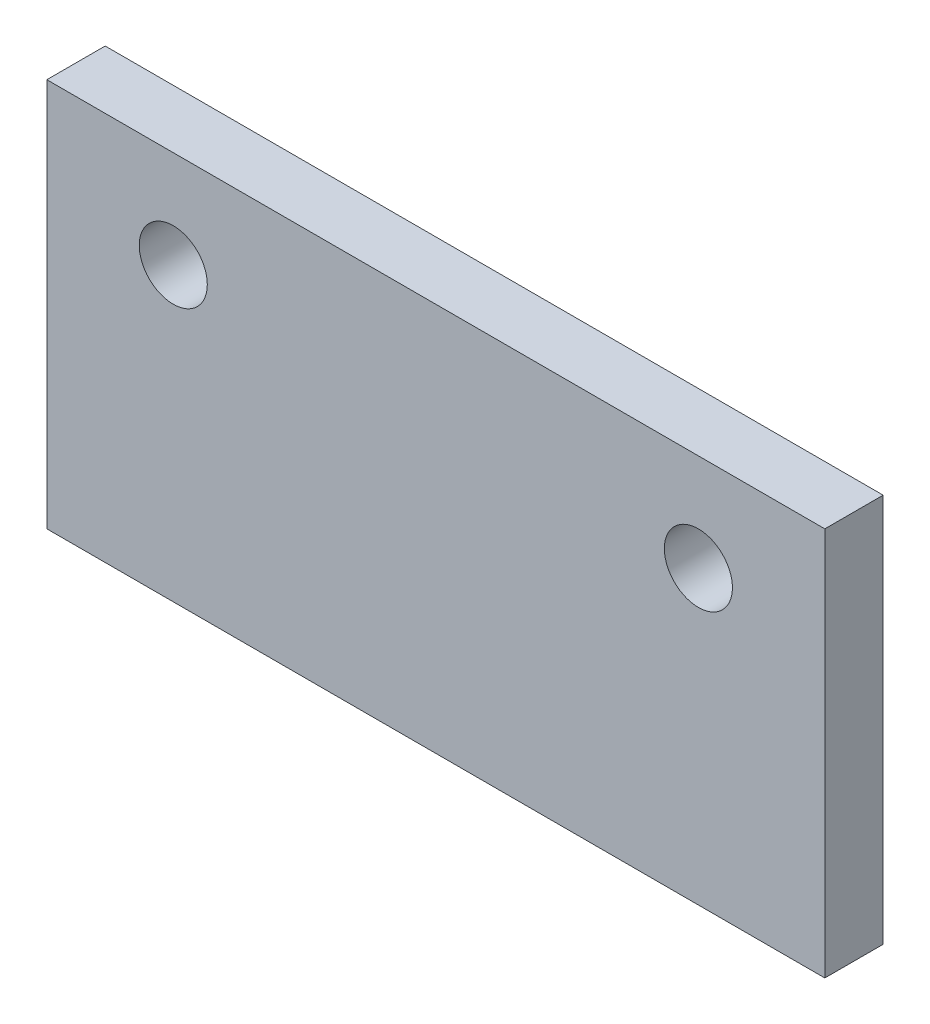
ISO-10303-21;
HEADER;
FILE_DESCRIPTION(('STEP AP214'),'2;1');
FILE_NAME('part.step','',(''),(''),'','','');
FILE_SCHEMA(('AUTOMOTIVE_DESIGN { 1 0 10303 214 1 1 1 1 }'));
ENDSEC;
DATA;
#1=APPLICATION_CONTEXT('core data for automotive mechanical design processes');
#2=APPLICATION_PROTOCOL_DEFINITION('international standard','automotive_design',2000,#1);
#3=PRODUCT_CONTEXT('',#1,'mechanical');
#4=PRODUCT('Part','Part','',(#3));
#5=PRODUCT_RELATED_PRODUCT_CATEGORY('part','',(#4));
#6=PRODUCT_DEFINITION_FORMATION('','',#4);
#7=PRODUCT_DEFINITION_CONTEXT('part definition',#1,'design');
#8=PRODUCT_DEFINITION('design','',#6,#7);
#9=PRODUCT_DEFINITION_SHAPE('','',#8);
#10=(LENGTH_UNIT() NAMED_UNIT(*) SI_UNIT(.MILLI.,.METRE.));
#11=(NAMED_UNIT(*) PLANE_ANGLE_UNIT() SI_UNIT($,.RADIAN.));
#12=(NAMED_UNIT(*) SI_UNIT($,.STERADIAN.) SOLID_ANGLE_UNIT());
#13=UNCERTAINTY_MEASURE_WITH_UNIT(LENGTH_MEASURE(1.E-05),#10,'distance_accuracy_value','');
#14=(GEOMETRIC_REPRESENTATION_CONTEXT(3) GLOBAL_UNCERTAINTY_ASSIGNED_CONTEXT((#13)) GLOBAL_UNIT_ASSIGNED_CONTEXT((#10,
#11,#12)) REPRESENTATION_CONTEXT('',''));
#15=CARTESIAN_POINT('',(0.,0.,0.));
#16=DIRECTION('',(0.,0.,1.));
#17=DIRECTION('',(1.,0.,0.));
#18=AXIS2_PLACEMENT_3D('',#15,#16,#17);
#19=CARTESIAN_POINT('',(0.,0.,3.));
#20=DIRECTION('',(0.,0.,1.));
#21=DIRECTION('',(1.,0.,0.));
#22=AXIS2_PLACEMENT_3D('',#19,#20,#21);
#23=PLANE('',#22);
#24=CARTESIAN_POINT('',(-13.5,5.,3.));
#25=DIRECTION('',(0.,0.,1.));
#26=DIRECTION('',(1.,0.,0.));
#27=AXIS2_PLACEMENT_3D('',#24,#25,#26);
#28=CIRCLE('',#27,1.75);
#29=CARTESIAN_POINT('',(-11.75,5.,3.));
#30=VERTEX_POINT('',#29);
#31=EDGE_CURVE('E99',#30,#30,#28,.T.);
#32=ORIENTED_EDGE('',*,*,#31,.F.);
#33=EDGE_LOOP('',(#32));
#34=FACE_BOUND('',#33,.T.);
#35=DIRECTION('',(0.,-1.,0.));
#36=VECTOR('',#35,1.);
#37=CARTESIAN_POINT('',(-20.,10.,3.));
#38=LINE('',#37,#36);
#39=CARTESIAN_POINT('',(-20.,10.,3.));
#40=VERTEX_POINT('',#39);
#41=CARTESIAN_POINT('',(-20.,-10.,3.));
#42=VERTEX_POINT('',#41);
#43=EDGE_CURVE('E84',#40,#42,#38,.T.);
#44=ORIENTED_EDGE('',*,*,#43,.T.);
#45=DIRECTION('',(1.,0.,0.));
#46=VECTOR('',#45,1.);
#47=CARTESIAN_POINT('',(-20.,-10.,3.));
#48=LINE('',#47,#46);
#49=CARTESIAN_POINT('',(20.,-10.,3.));
#50=VERTEX_POINT('',#49);
#51=EDGE_CURVE('E79',#42,#50,#48,.T.);
#52=ORIENTED_EDGE('',*,*,#51,.T.);
#53=DIRECTION('',(0.,1.,0.));
#54=VECTOR('',#53,1.);
#55=CARTESIAN_POINT('',(20.,10.,3.));
#56=LINE('',#55,#54);
#57=CARTESIAN_POINT('',(20.,10.,3.));
#58=VERTEX_POINT('',#57);
#59=EDGE_CURVE('E82',#50,#58,#56,.T.);
#60=ORIENTED_EDGE('',*,*,#59,.T.);
#61=DIRECTION('',(-1.,0.,0.));
#62=VECTOR('',#61,1.);
#63=CARTESIAN_POINT('',(-20.,10.,3.));
#64=LINE('',#63,#62);
#65=EDGE_CURVE('E49',#58,#40,#64,.T.);
#66=ORIENTED_EDGE('',*,*,#65,.T.);
#67=EDGE_LOOP('',(#44,#52,#60,#66));
#68=FACE_BOUND('',#67,.T.);
#69=CARTESIAN_POINT('',(13.5,5.,3.));
#70=DIRECTION('',(0.,0.,1.));
#71=DIRECTION('',(-1.,0.,0.));
#72=AXIS2_PLACEMENT_3D('',#69,#70,#71);
#73=CIRCLE('',#72,1.75);
#74=CARTESIAN_POINT('',(11.75,5.,3.));
#75=VERTEX_POINT('',#74);
#76=EDGE_CURVE('E114',#75,#75,#73,.T.);
#77=ORIENTED_EDGE('',*,*,#76,.F.);
#78=EDGE_LOOP('',(#77));
#79=FACE_BOUND('',#78,.T.);
#80=ADVANCED_FACE('F32',(#34,#68,#79),#23,.T.);
#81=CARTESIAN_POINT('',(0.,0.,0.));
#82=DIRECTION('',(0.,0.,1.));
#83=DIRECTION('',(1.,0.,0.));
#84=AXIS2_PLACEMENT_3D('',#81,#82,#83);
#85=PLANE('',#84);
#86=CARTESIAN_POINT('',(-13.5,5.,0.));
#87=DIRECTION('',(0.,0.,1.));
#88=DIRECTION('',(1.,0.,0.));
#89=AXIS2_PLACEMENT_3D('',#86,#87,#88);
#90=CIRCLE('',#89,1.75);
#91=CARTESIAN_POINT('',(-11.75,5.,0.));
#92=VERTEX_POINT('',#91);
#93=EDGE_CURVE('E111',#92,#92,#90,.T.);
#94=ORIENTED_EDGE('',*,*,#93,.T.);
#95=EDGE_LOOP('',(#94));
#96=FACE_BOUND('',#95,.T.);
#97=DIRECTION('',(0.,-1.,0.));
#98=VECTOR('',#97,1.);
#99=CARTESIAN_POINT('',(-20.,10.,0.));
#100=LINE('',#99,#98);
#101=CARTESIAN_POINT('',(-20.,10.,0.));
#102=VERTEX_POINT('',#101);
#103=CARTESIAN_POINT('',(-20.,-10.,0.));
#104=VERTEX_POINT('',#103);
#105=EDGE_CURVE('E96',#102,#104,#100,.T.);
#106=ORIENTED_EDGE('',*,*,#105,.F.);
#107=DIRECTION('',(-1.,0.,0.));
#108=VECTOR('',#107,1.);
#109=CARTESIAN_POINT('',(-20.,10.,0.));
#110=LINE('',#109,#108);
#111=CARTESIAN_POINT('',(20.,10.,0.));
#112=VERTEX_POINT('',#111);
#113=EDGE_CURVE('E72',#112,#102,#110,.T.);
#114=ORIENTED_EDGE('',*,*,#113,.F.);
#115=DIRECTION('',(0.,1.,0.));
#116=VECTOR('',#115,1.);
#117=CARTESIAN_POINT('',(20.,10.,0.));
#118=LINE('',#117,#116);
#119=CARTESIAN_POINT('',(20.,-10.,0.));
#120=VERTEX_POINT('',#119);
#121=EDGE_CURVE('E66',#120,#112,#118,.T.);
#122=ORIENTED_EDGE('',*,*,#121,.F.);
#123=DIRECTION('',(1.,0.,0.));
#124=VECTOR('',#123,1.);
#125=CARTESIAN_POINT('',(-20.,-10.,0.));
#126=LINE('',#125,#124);
#127=EDGE_CURVE('E88',#104,#120,#126,.T.);
#128=ORIENTED_EDGE('',*,*,#127,.F.);
#129=EDGE_LOOP('',(#106,#114,#122,#128));
#130=FACE_BOUND('',#129,.T.);
#131=CARTESIAN_POINT('',(13.5,5.,0.));
#132=DIRECTION('',(0.,0.,1.));
#133=DIRECTION('',(-1.,0.,0.));
#134=AXIS2_PLACEMENT_3D('',#131,#132,#133);
#135=CIRCLE('',#134,1.75);
#136=CARTESIAN_POINT('',(11.75,5.,0.));
#137=VERTEX_POINT('',#136);
#138=EDGE_CURVE('E117',#137,#137,#135,.T.);
#139=ORIENTED_EDGE('',*,*,#138,.T.);
#140=EDGE_LOOP('',(#139));
#141=FACE_BOUND('',#140,.T.);
#142=ADVANCED_FACE('F107',(#96,#130,#141),#85,.F.);
#143=CARTESIAN_POINT('',(-20.,10.,3.));
#144=DIRECTION('',(1.,0.,0.));
#145=DIRECTION('',(0.,0.,-1.));
#146=AXIS2_PLACEMENT_3D('',#143,#144,#145);
#147=PLANE('',#146);
#148=ORIENTED_EDGE('',*,*,#105,.T.);
#149=DIRECTION('',(0.,0.,-1.));
#150=VECTOR('',#149,1.);
#151=CARTESIAN_POINT('',(-20.,-10.,3.));
#152=LINE('',#151,#150);
#153=EDGE_CURVE('E11',#42,#104,#152,.T.);
#154=ORIENTED_EDGE('',*,*,#153,.F.);
#155=ORIENTED_EDGE('',*,*,#43,.F.);
#156=DIRECTION('',(0.,0.,-1.));
#157=VECTOR('',#156,1.);
#158=CARTESIAN_POINT('',(-20.,10.,3.));
#159=LINE('',#158,#157);
#160=EDGE_CURVE('E92',#40,#102,#159,.T.);
#161=ORIENTED_EDGE('',*,*,#160,.T.);
#162=EDGE_LOOP('',(#148,#154,#155,#161));
#163=FACE_BOUND('',#162,.T.);
#164=ADVANCED_FACE('F34',(#163),#147,.F.);
#165=CARTESIAN_POINT('',(-20.,-10.,3.));
#166=DIRECTION('',(0.,1.,0.));
#167=DIRECTION('',(-1.,0.,0.));
#168=AXIS2_PLACEMENT_3D('',#165,#166,#167);
#169=PLANE('',#168);
#170=ORIENTED_EDGE('',*,*,#127,.T.);
#171=DIRECTION('',(0.,0.,-1.));
#172=VECTOR('',#171,1.);
#173=CARTESIAN_POINT('',(20.,-10.,3.));
#174=LINE('',#173,#172);
#175=EDGE_CURVE('E41',#50,#120,#174,.T.);
#176=ORIENTED_EDGE('',*,*,#175,.F.);
#177=ORIENTED_EDGE('',*,*,#51,.F.);
#178=ORIENTED_EDGE('',*,*,#153,.T.);
#179=EDGE_LOOP('',(#170,#176,#177,#178));
#180=FACE_BOUND('',#179,.T.);
#181=ADVANCED_FACE('F87',(#180),#169,.F.);
#182=CARTESIAN_POINT('',(20.,10.,3.));
#183=DIRECTION('',(-1.,0.,0.));
#184=DIRECTION('',(0.,0.,1.));
#185=AXIS2_PLACEMENT_3D('',#182,#183,#184);
#186=PLANE('',#185);
#187=ORIENTED_EDGE('',*,*,#121,.T.);
#188=DIRECTION('',(0.,0.,-1.));
#189=VECTOR('',#188,1.);
#190=CARTESIAN_POINT('',(20.,10.,3.));
#191=LINE('',#190,#189);
#192=EDGE_CURVE('E89',#58,#112,#191,.T.);
#193=ORIENTED_EDGE('',*,*,#192,.F.);
#194=ORIENTED_EDGE('',*,*,#59,.F.);
#195=ORIENTED_EDGE('',*,*,#175,.T.);
#196=EDGE_LOOP('',(#187,#193,#194,#195));
#197=FACE_BOUND('',#196,.T.);
#198=ADVANCED_FACE('F90',(#197),#186,.F.);
#199=CARTESIAN_POINT('',(-20.,10.,3.));
#200=DIRECTION('',(0.,-1.,0.));
#201=DIRECTION('',(1.,0.,0.));
#202=AXIS2_PLACEMENT_3D('',#199,#200,#201);
#203=PLANE('',#202);
#204=ORIENTED_EDGE('',*,*,#113,.T.);
#205=ORIENTED_EDGE('',*,*,#160,.F.);
#206=ORIENTED_EDGE('',*,*,#65,.F.);
#207=ORIENTED_EDGE('',*,*,#192,.T.);
#208=EDGE_LOOP('',(#204,#205,#206,#207));
#209=FACE_BOUND('',#208,.T.);
#210=ADVANCED_FACE('F104',(#209),#203,.F.);
#211=CARTESIAN_POINT('',(-13.5,5.,3.));
#212=DIRECTION('',(0.,0.,-1.));
#213=DIRECTION('',(-1.,0.,0.));
#214=AXIS2_PLACEMENT_3D('',#211,#212,#213);
#215=CYLINDRICAL_SURFACE('',#214,1.75);
#216=ORIENTED_EDGE('',*,*,#31,.T.);
#217=EDGE_LOOP('',(#216));
#218=FACE_BOUND('',#217,.T.);
#219=ORIENTED_EDGE('',*,*,#93,.F.);
#220=EDGE_LOOP('',(#219));
#221=FACE_BOUND('',#220,.T.);
#222=ADVANCED_FACE('F135',(#218,#221),#215,.F.);
#223=CARTESIAN_POINT('',(13.5,5.,3.));
#224=DIRECTION('',(0.,0.,-1.));
#225=DIRECTION('',(-1.,0.,0.));
#226=AXIS2_PLACEMENT_3D('',#223,#224,#225);
#227=CYLINDRICAL_SURFACE('',#226,1.75);
#228=ORIENTED_EDGE('',*,*,#76,.T.);
#229=EDGE_LOOP('',(#228));
#230=FACE_BOUND('',#229,.T.);
#231=ORIENTED_EDGE('',*,*,#138,.F.);
#232=EDGE_LOOP('',(#231));
#233=FACE_BOUND('',#232,.T.);
#234=ADVANCED_FACE('F123',(#230,#233),#227,.F.);
#235=CLOSED_SHELL('',(#80,#142,#164,#181,#198,#210,#222,#234));
#236=MANIFOLD_SOLID_BREP('B2',#235);
#237=ADVANCED_BREP_SHAPE_REPRESENTATION('',(#18,#236),#14);
#238=SHAPE_DEFINITION_REPRESENTATION(#9,#237);
ENDSEC;
END-ISO-10303-21;
